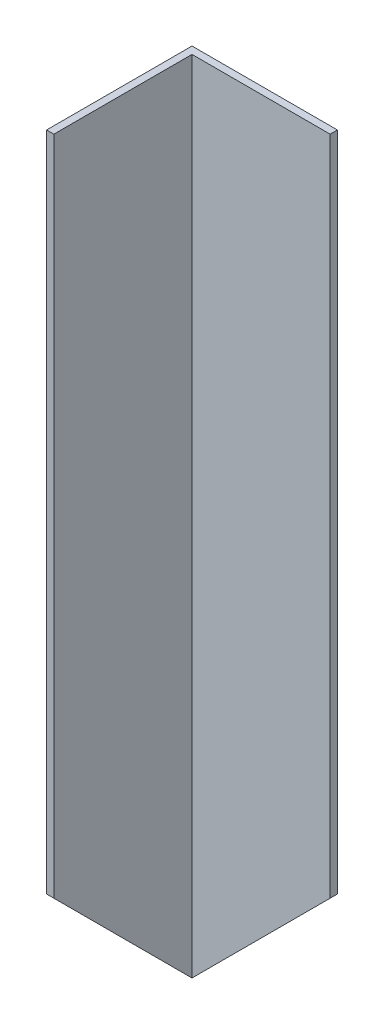
ISO-10303-21;
HEADER;
FILE_DESCRIPTION(('STEP AP214'),'2;1');
FILE_NAME('part.step','',(''),(''),'','','');
FILE_SCHEMA(('AUTOMOTIVE_DESIGN { 1 0 10303 214 1 1 1 1 }'));
ENDSEC;
DATA;
#1=APPLICATION_CONTEXT('core data for automotive mechanical design processes');
#2=APPLICATION_PROTOCOL_DEFINITION('international standard','automotive_design',2000,#1);
#3=PRODUCT_CONTEXT('',#1,'mechanical');
#4=PRODUCT('Part','Part','',(#3));
#5=PRODUCT_RELATED_PRODUCT_CATEGORY('part','',(#4));
#6=PRODUCT_DEFINITION_FORMATION('','',#4);
#7=PRODUCT_DEFINITION_CONTEXT('part definition',#1,'design');
#8=PRODUCT_DEFINITION('design','',#6,#7);
#9=PRODUCT_DEFINITION_SHAPE('','',#8);
#10=(LENGTH_UNIT() NAMED_UNIT(*) SI_UNIT(.MILLI.,.METRE.));
#11=(NAMED_UNIT(*) PLANE_ANGLE_UNIT() SI_UNIT($,.RADIAN.));
#12=(NAMED_UNIT(*) SI_UNIT($,.STERADIAN.) SOLID_ANGLE_UNIT());
#13=UNCERTAINTY_MEASURE_WITH_UNIT(LENGTH_MEASURE(1.E-05),#10,'distance_accuracy_value','');
#14=(GEOMETRIC_REPRESENTATION_CONTEXT(3) GLOBAL_UNCERTAINTY_ASSIGNED_CONTEXT((#13)) GLOBAL_UNIT_ASSIGNED_CONTEXT((#10,
#11,#12)) REPRESENTATION_CONTEXT('',''));
#15=CARTESIAN_POINT('',(0.,0.,0.));
#16=DIRECTION('',(0.,0.,1.));
#17=DIRECTION('',(1.,0.,0.));
#18=AXIS2_PLACEMENT_3D('',#15,#16,#17);
#19=CARTESIAN_POINT('',(-20.,222.,-20.1136363636364));
#20=DIRECTION('',(1.,0.,0.));
#21=DIRECTION('',(0.,0.,-1.));
#22=AXIS2_PLACEMENT_3D('',#19,#20,#21);
#23=PLANE('',#22);
#24=DIRECTION('',(0.,-1.,0.));
#25=VECTOR('',#24,1.);
#26=CARTESIAN_POINT('',(-20.,222.,-20.1136363636364));
#27=LINE('',#26,#25);
#28=CARTESIAN_POINT('',(-20.,222.,-20.1136363636364));
#29=VERTEX_POINT('',#28);
#30=CARTESIAN_POINT('',(-20.,0.,-20.1136363636364));
#31=VERTEX_POINT('',#30);
#32=EDGE_CURVE('E99',#29,#31,#27,.T.);
#33=ORIENTED_EDGE('',*,*,#32,.T.);
#34=DIRECTION('',(0.,-0.707106781186544,-0.707106781186551));
#35=VECTOR('',#34,1.);
#36=CARTESIAN_POINT('',(-20.,0.,-20.1136363636364));
#37=LINE('',#36,#35);
#38=CARTESIAN_POINT('',(-20.,39.9999999999996,19.8863636363636));
#39=VERTEX_POINT('',#38);
#40=EDGE_CURVE('E87',#39,#31,#37,.T.);
#41=ORIENTED_EDGE('',*,*,#40,.F.);
#42=DIRECTION('',(0.,-1.,0.));
#43=VECTOR('',#42,1.);
#44=CARTESIAN_POINT('',(-20.,222.,19.8863636363636));
#45=LINE('',#44,#43);
#46=CARTESIAN_POINT('',(-20.,222.,19.8863636363636));
#47=VERTEX_POINT('',#46);
#48=EDGE_CURVE('E40',#47,#39,#45,.T.);
#49=ORIENTED_EDGE('',*,*,#48,.F.);
#50=DIRECTION('',(0.,0.,1.));
#51=VECTOR('',#50,1.);
#52=CARTESIAN_POINT('',(-20.,222.,-20.1136363636364));
#53=LINE('',#52,#51);
#54=EDGE_CURVE('E123',#29,#47,#53,.T.);
#55=ORIENTED_EDGE('',*,*,#54,.F.);
#56=EDGE_LOOP('',(#33,#41,#49,#55));
#57=FACE_BOUND('',#56,.T.);
#58=ADVANCED_FACE('F33',(#57),#23,.F.);
#59=CARTESIAN_POINT('',(-20.,222.,19.8863636363636));
#60=DIRECTION('',(0.,0.,-1.));
#61=DIRECTION('',(-1.,0.,0.));
#62=AXIS2_PLACEMENT_3D('',#59,#60,#61);
#63=PLANE('',#62);
#64=ORIENTED_EDGE('',*,*,#48,.T.);
#65=DIRECTION('',(-1.,0.,0.));
#66=VECTOR('',#65,1.);
#67=CARTESIAN_POINT('',(570.,39.9999999999996,19.8863636363635));
#68=LINE('',#67,#66);
#69=CARTESIAN_POINT('',(-18.,39.9999999999996,19.8863636363636));
#70=VERTEX_POINT('',#69);
#71=EDGE_CURVE('E84',#70,#39,#68,.T.);
#72=ORIENTED_EDGE('',*,*,#71,.F.);
#73=DIRECTION('',(0.,-1.,0.));
#74=VECTOR('',#73,1.);
#75=CARTESIAN_POINT('',(-18.,222.,19.8863636363636));
#76=LINE('',#75,#74);
#77=CARTESIAN_POINT('',(-18.,222.,19.8863636363636));
#78=VERTEX_POINT('',#77);
#79=EDGE_CURVE('E103',#78,#70,#76,.T.);
#80=ORIENTED_EDGE('',*,*,#79,.F.);
#81=DIRECTION('',(1.,0.,0.));
#82=VECTOR('',#81,1.);
#83=CARTESIAN_POINT('',(-20.,222.,19.8863636363636));
#84=LINE('',#83,#82);
#85=EDGE_CURVE('E102',#47,#78,#84,.T.);
#86=ORIENTED_EDGE('',*,*,#85,.F.);
#87=EDGE_LOOP('',(#64,#72,#80,#86));
#88=FACE_BOUND('',#87,.T.);
#89=ADVANCED_FACE('F101',(#88),#63,.F.);
#90=CARTESIAN_POINT('',(-18.,222.,-18.1136363636364));
#91=DIRECTION('',(-1.,0.,0.));
#92=DIRECTION('',(0.,0.,1.));
#93=AXIS2_PLACEMENT_3D('',#90,#91,#92);
#94=PLANE('',#93);
#95=ORIENTED_EDGE('',*,*,#79,.T.);
#96=DIRECTION('',(0.,-0.707106781186544,-0.707106781186551));
#97=VECTOR('',#96,1.);
#98=CARTESIAN_POINT('',(-18.,111.999999999999,91.8863636363636));
#99=LINE('',#98,#97);
#100=CARTESIAN_POINT('',(-18.,1.99999999999997,-18.1136363636364));
#101=VERTEX_POINT('',#100);
#102=EDGE_CURVE('E89',#70,#101,#99,.T.);
#103=ORIENTED_EDGE('',*,*,#102,.T.);
#104=DIRECTION('',(0.,-1.,0.));
#105=VECTOR('',#104,1.);
#106=CARTESIAN_POINT('',(-18.,222.,-18.1136363636364));
#107=LINE('',#106,#105);
#108=CARTESIAN_POINT('',(-18.,222.,-18.1136363636364));
#109=VERTEX_POINT('',#108);
#110=EDGE_CURVE('E104',#109,#101,#107,.T.);
#111=ORIENTED_EDGE('',*,*,#110,.F.);
#112=DIRECTION('',(0.,0.,-1.));
#113=VECTOR('',#112,1.);
#114=CARTESIAN_POINT('',(-18.,222.,-18.1136363636364));
#115=LINE('',#114,#113);
#116=EDGE_CURVE('E120',#78,#109,#115,.T.);
#117=ORIENTED_EDGE('',*,*,#116,.F.);
#118=EDGE_LOOP('',(#95,#103,#111,#117));
#119=FACE_BOUND('',#118,.T.);
#120=ADVANCED_FACE('F136',(#119),#94,.F.);
#121=CARTESIAN_POINT('',(-18.,222.,-18.1136363636364));
#122=DIRECTION('',(0.,0.,-1.));
#123=DIRECTION('',(-1.,0.,0.));
#124=AXIS2_PLACEMENT_3D('',#121,#122,#123);
#125=PLANE('',#124);
#126=ORIENTED_EDGE('',*,*,#110,.T.);
#127=DIRECTION('',(0.707106781186547,0.707106781186549,0.));
#128=VECTOR('',#127,1.);
#129=CARTESIAN_POINT('',(92.,112.,-18.1136363636364));
#130=LINE('',#129,#128);
#131=CARTESIAN_POINT('',(20.,40.0000000000001,-18.1136363636364));
#132=VERTEX_POINT('',#131);
#133=EDGE_CURVE('E125',#101,#132,#130,.T.);
#134=ORIENTED_EDGE('',*,*,#133,.T.);
#135=DIRECTION('',(0.,-1.,0.));
#136=VECTOR('',#135,1.);
#137=CARTESIAN_POINT('',(20.,222.,-18.1136363636364));
#138=LINE('',#137,#136);
#139=CARTESIAN_POINT('',(20.,222.,-18.1136363636364));
#140=VERTEX_POINT('',#139);
#141=EDGE_CURVE('E109',#140,#132,#138,.T.);
#142=ORIENTED_EDGE('',*,*,#141,.F.);
#143=DIRECTION('',(1.,0.,0.));
#144=VECTOR('',#143,1.);
#145=CARTESIAN_POINT('',(-18.,222.,-18.1136363636364));
#146=LINE('',#145,#144);
#147=EDGE_CURVE('E118',#109,#140,#146,.T.);
#148=ORIENTED_EDGE('',*,*,#147,.F.);
#149=EDGE_LOOP('',(#126,#134,#142,#148));
#150=FACE_BOUND('',#149,.T.);
#151=ADVANCED_FACE('F144',(#150),#125,.F.);
#152=CARTESIAN_POINT('',(20.,222.,-20.1136363636364));
#153=DIRECTION('',(-1.,0.,0.));
#154=DIRECTION('',(0.,0.,1.));
#155=AXIS2_PLACEMENT_3D('',#152,#153,#154);
#156=PLANE('',#155);
#157=ORIENTED_EDGE('',*,*,#141,.T.);
#158=DIRECTION('',(0.,0.,-1.));
#159=VECTOR('',#158,1.);
#160=CARTESIAN_POINT('',(20.,40.0000000000001,569.886363636364));
#161=LINE('',#160,#159);
#162=CARTESIAN_POINT('',(20.,40.0000000000001,-20.1136363636364));
#163=VERTEX_POINT('',#162);
#164=EDGE_CURVE('E128',#132,#163,#161,.T.);
#165=ORIENTED_EDGE('',*,*,#164,.T.);
#166=DIRECTION('',(0.,-1.,0.));
#167=VECTOR('',#166,1.);
#168=CARTESIAN_POINT('',(20.,222.,-20.1136363636364));
#169=LINE('',#168,#167);
#170=CARTESIAN_POINT('',(20.,222.,-20.1136363636364));
#171=VERTEX_POINT('',#170);
#172=EDGE_CURVE('E112',#171,#163,#169,.T.);
#173=ORIENTED_EDGE('',*,*,#172,.F.);
#174=DIRECTION('',(0.,0.,-1.));
#175=VECTOR('',#174,1.);
#176=CARTESIAN_POINT('',(20.,222.,-20.1136363636364));
#177=LINE('',#176,#175);
#178=EDGE_CURVE('E52',#140,#171,#177,.T.);
#179=ORIENTED_EDGE('',*,*,#178,.F.);
#180=EDGE_LOOP('',(#157,#165,#173,#179));
#181=FACE_BOUND('',#180,.T.);
#182=ADVANCED_FACE('F154',(#181),#156,.F.);
#183=CARTESIAN_POINT('',(-20.,222.,-20.1136363636364));
#184=DIRECTION('',(0.,0.,1.));
#185=DIRECTION('',(1.,0.,0.));
#186=AXIS2_PLACEMENT_3D('',#183,#184,#185);
#187=PLANE('',#186);
#188=ORIENTED_EDGE('',*,*,#172,.T.);
#189=DIRECTION('',(0.707106781186546,0.707106781186548,0.));
#190=VECTOR('',#189,1.);
#191=CARTESIAN_POINT('',(-20.,0.,-20.1136363636364));
#192=LINE('',#191,#190);
#193=EDGE_CURVE('E131',#31,#163,#192,.T.);
#194=ORIENTED_EDGE('',*,*,#193,.F.);
#195=ORIENTED_EDGE('',*,*,#32,.F.);
#196=DIRECTION('',(-1.,0.,0.));
#197=VECTOR('',#196,1.);
#198=CARTESIAN_POINT('',(-20.,222.,-20.1136363636364));
#199=LINE('',#198,#197);
#200=EDGE_CURVE('E47',#171,#29,#199,.T.);
#201=ORIENTED_EDGE('',*,*,#200,.F.);
#202=EDGE_LOOP('',(#188,#194,#195,#201));
#203=FACE_BOUND('',#202,.T.);
#204=ADVANCED_FACE('F147',(#203),#187,.F.);
#205=CARTESIAN_POINT('',(0.,222.,0.));
#206=DIRECTION('',(0.,1.,0.));
#207=DIRECTION('',(0.,0.,1.));
#208=AXIS2_PLACEMENT_3D('',#205,#206,#207);
#209=PLANE('',#208);
#210=ORIENTED_EDGE('',*,*,#54,.T.);
#211=ORIENTED_EDGE('',*,*,#85,.T.);
#212=ORIENTED_EDGE('',*,*,#116,.T.);
#213=ORIENTED_EDGE('',*,*,#147,.T.);
#214=ORIENTED_EDGE('',*,*,#178,.T.);
#215=ORIENTED_EDGE('',*,*,#200,.T.);
#216=EDGE_LOOP('',(#210,#211,#212,#213,#214,#215));
#217=FACE_BOUND('',#216,.T.);
#218=ADVANCED_FACE('F145',(#217),#209,.T.);
#219=CARTESIAN_POINT('',(-20.,0.,569.886363636364));
#220=DIRECTION('',(-0.707106781186549,0.707106781186547,0.));
#221=DIRECTION('',(-0.707106781186547,-0.707106781186549,0.));
#222=AXIS2_PLACEMENT_3D('',#219,#220,#221);
#223=PLANE('',#222);
#224=ORIENTED_EDGE('',*,*,#133,.F.);
#225=DIRECTION('',(-0.577350269189623,-0.577350269189624,-0.57735026918963));
#226=VECTOR('',#225,1.);
#227=CARTESIAN_POINT('',(176.666666666667,196.666666666668,176.553030303033));
#228=LINE('',#227,#226);
#229=EDGE_CURVE('E11',#101,#31,#228,.T.);
#230=ORIENTED_EDGE('',*,*,#229,.T.);
#231=ORIENTED_EDGE('',*,*,#193,.T.);
#232=ORIENTED_EDGE('',*,*,#164,.F.);
#233=EDGE_LOOP('',(#224,#230,#231,#232));
#234=FACE_BOUND('',#233,.T.);
#235=ADVANCED_FACE('F140',(#234),#223,.F.);
#236=CARTESIAN_POINT('',(570.,0.,-20.1136363636365));
#237=DIRECTION('',(0.,0.707106781186551,-0.707106781186544));
#238=DIRECTION('',(0.,0.707106781186544,0.707106781186551));
#239=AXIS2_PLACEMENT_3D('',#236,#237,#238);
#240=PLANE('',#239);
#241=ORIENTED_EDGE('',*,*,#71,.T.);
#242=ORIENTED_EDGE('',*,*,#40,.T.);
#243=ORIENTED_EDGE('',*,*,#229,.F.);
#244=ORIENTED_EDGE('',*,*,#102,.F.);
#245=EDGE_LOOP('',(#241,#242,#243,#244));
#246=FACE_BOUND('',#245,.T.);
#247=ADVANCED_FACE('F86',(#246),#240,.F.);
#248=CLOSED_SHELL('',(#58,#89,#120,#151,#182,#204,#218,#235,#247));
#249=MANIFOLD_SOLID_BREP('B2',#248);
#250=ADVANCED_BREP_SHAPE_REPRESENTATION('',(#18,#249),#14);
#251=SHAPE_DEFINITION_REPRESENTATION(#9,#250);
ENDSEC;
END-ISO-10303-21;
